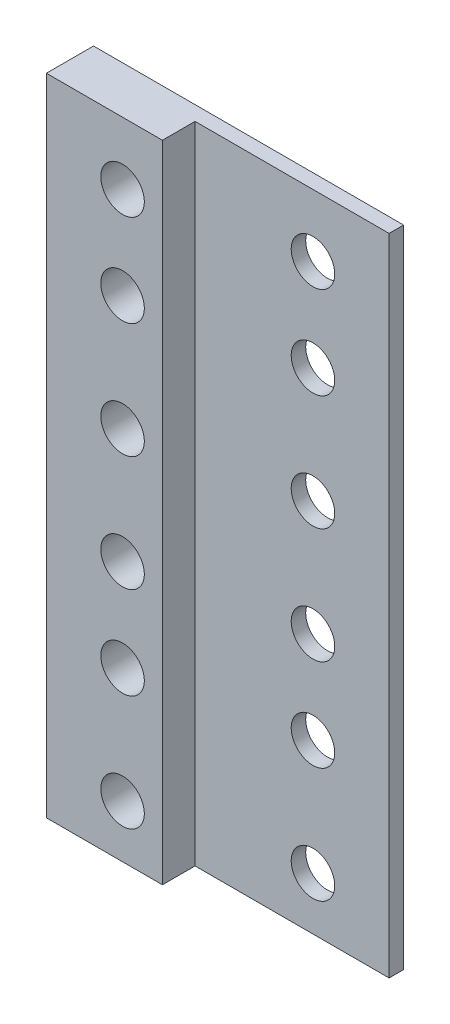
ISO-10303-21;
HEADER;
FILE_DESCRIPTION(('STEP AP214'),'2;1');
FILE_NAME('part.step','',(''),(''),'','','');
FILE_SCHEMA(('AUTOMOTIVE_DESIGN { 1 0 10303 214 1 1 1 1 }'));
ENDSEC;
DATA;
#1=APPLICATION_CONTEXT('core data for automotive mechanical design processes');
#2=APPLICATION_PROTOCOL_DEFINITION('international standard','automotive_design',2000,#1);
#3=PRODUCT_CONTEXT('',#1,'mechanical');
#4=PRODUCT('Part','Part','',(#3));
#5=PRODUCT_RELATED_PRODUCT_CATEGORY('part','',(#4));
#6=PRODUCT_DEFINITION_FORMATION('','',#4);
#7=PRODUCT_DEFINITION_CONTEXT('part definition',#1,'design');
#8=PRODUCT_DEFINITION('design','',#6,#7);
#9=PRODUCT_DEFINITION_SHAPE('','',#8);
#10=(LENGTH_UNIT() NAMED_UNIT(*) SI_UNIT(.MILLI.,.METRE.));
#11=(NAMED_UNIT(*) PLANE_ANGLE_UNIT() SI_UNIT($,.RADIAN.));
#12=(NAMED_UNIT(*) SI_UNIT($,.STERADIAN.) SOLID_ANGLE_UNIT());
#13=UNCERTAINTY_MEASURE_WITH_UNIT(LENGTH_MEASURE(1.E-05),#10,'distance_accuracy_value','');
#14=(GEOMETRIC_REPRESENTATION_CONTEXT(3) GLOBAL_UNCERTAINTY_ASSIGNED_CONTEXT((#13)) GLOBAL_UNIT_ASSIGNED_CONTEXT((#10,
#11,#12)) REPRESENTATION_CONTEXT('',''));
#15=CARTESIAN_POINT('',(0.,0.,0.));
#16=DIRECTION('',(0.,0.,1.));
#17=DIRECTION('',(1.,0.,0.));
#18=AXIS2_PLACEMENT_3D('',#15,#16,#17);
#19=CARTESIAN_POINT('',(0.,0.,2.));
#20=DIRECTION('',(0.,0.,-1.));
#21=DIRECTION('',(-1.,0.,0.));
#22=AXIS2_PLACEMENT_3D('',#19,#20,#21);
#23=PLANE('',#22);
#24=DIRECTION('',(-1.,0.,0.));
#25=VECTOR('',#24,1.);
#26=CARTESIAN_POINT('',(-25.25,88.9,2.));
#27=LINE('',#26,#25);
#28=CARTESIAN_POINT('',(17.5,88.9,2.));
#29=VERTEX_POINT('',#28);
#30=CARTESIAN_POINT('',(-9.24999999999999,88.9,2.));
#31=VERTEX_POINT('',#30);
#32=EDGE_CURVE('E55',#29,#31,#27,.T.);
#33=ORIENTED_EDGE('',*,*,#32,.T.);
#34=DIRECTION('',(0.,-1.,0.));
#35=VECTOR('',#34,1.);
#36=CARTESIAN_POINT('',(-9.24999999999999,0.,2.));
#37=LINE('',#36,#35);
#38=CARTESIAN_POINT('',(-9.24999999999999,0.,2.));
#39=VERTEX_POINT('',#38);
#40=EDGE_CURVE('E157',#31,#39,#37,.T.);
#41=ORIENTED_EDGE('',*,*,#40,.T.);
#42=DIRECTION('',(1.,0.,0.));
#43=VECTOR('',#42,1.);
#44=CARTESIAN_POINT('',(-25.25,0.,2.));
#45=LINE('',#44,#43);
#46=CARTESIAN_POINT('',(17.5,0.,2.));
#47=VERTEX_POINT('',#46);
#48=EDGE_CURVE('E93',#39,#47,#45,.T.);
#49=ORIENTED_EDGE('',*,*,#48,.T.);
#50=DIRECTION('',(0.,1.,0.));
#51=VECTOR('',#50,1.);
#52=CARTESIAN_POINT('',(17.5,0.,2.));
#53=LINE('',#52,#51);
#54=EDGE_CURVE('E61',#47,#29,#53,.T.);
#55=ORIENTED_EDGE('',*,*,#54,.T.);
#56=EDGE_LOOP('',(#33,#41,#49,#55));
#57=FACE_BOUND('',#56,.T.);
#58=CARTESIAN_POINT('',(6.99999999999999,80.29,2.));
#59=DIRECTION('',(0.,0.,-1.));
#60=DIRECTION('',(-1.,0.,0.));
#61=AXIS2_PLACEMENT_3D('',#58,#59,#60);
#62=CIRCLE('',#61,3.);
#63=CARTESIAN_POINT('',(3.99999999999999,80.29,2.));
#64=VERTEX_POINT('',#63);
#65=EDGE_CURVE('E109',#64,#64,#62,.T.);
#66=ORIENTED_EDGE('',*,*,#65,.T.);
#67=EDGE_LOOP('',(#66));
#68=FACE_BOUND('',#67,.T.);
#69=CARTESIAN_POINT('',(6.99999999999999,67.59,2.));
#70=DIRECTION('',(0.,0.,-1.));
#71=DIRECTION('',(-1.,0.,0.));
#72=AXIS2_PLACEMENT_3D('',#69,#70,#71);
#73=CIRCLE('',#72,3.);
#74=CARTESIAN_POINT('',(3.99999999999999,67.59,2.));
#75=VERTEX_POINT('',#74);
#76=EDGE_CURVE('E216',#75,#75,#73,.T.);
#77=ORIENTED_EDGE('',*,*,#76,.T.);
#78=EDGE_LOOP('',(#77));
#79=FACE_BOUND('',#78,.T.);
#80=CARTESIAN_POINT('',(6.99999999999999,51.71,2.));
#81=DIRECTION('',(0.,0.,-1.));
#82=DIRECTION('',(-1.,0.,0.));
#83=AXIS2_PLACEMENT_3D('',#80,#81,#82);
#84=CIRCLE('',#83,3.);
#85=CARTESIAN_POINT('',(3.99999999999999,51.71,2.));
#86=VERTEX_POINT('',#85);
#87=EDGE_CURVE('E204',#86,#86,#84,.T.);
#88=ORIENTED_EDGE('',*,*,#87,.T.);
#89=EDGE_LOOP('',(#88));
#90=FACE_BOUND('',#89,.T.);
#91=CARTESIAN_POINT('',(6.99999999999999,35.83,2.));
#92=DIRECTION('',(0.,0.,-1.));
#93=DIRECTION('',(-1.,0.,0.));
#94=AXIS2_PLACEMENT_3D('',#91,#92,#93);
#95=CIRCLE('',#94,3.);
#96=CARTESIAN_POINT('',(3.99999999999999,35.83,2.));
#97=VERTEX_POINT('',#96);
#98=EDGE_CURVE('E192',#97,#97,#95,.T.);
#99=ORIENTED_EDGE('',*,*,#98,.T.);
#100=EDGE_LOOP('',(#99));
#101=FACE_BOUND('',#100,.T.);
#102=CARTESIAN_POINT('',(6.99999999999999,23.13,2.));
#103=DIRECTION('',(0.,0.,-1.));
#104=DIRECTION('',(-1.,0.,0.));
#105=AXIS2_PLACEMENT_3D('',#102,#103,#104);
#106=CIRCLE('',#105,3.);
#107=CARTESIAN_POINT('',(3.99999999999999,23.13,2.));
#108=VERTEX_POINT('',#107);
#109=EDGE_CURVE('E180',#108,#108,#106,.T.);
#110=ORIENTED_EDGE('',*,*,#109,.T.);
#111=EDGE_LOOP('',(#110));
#112=FACE_BOUND('',#111,.T.);
#113=CARTESIAN_POINT('',(6.99999999999999,7.24999999999998,2.));
#114=DIRECTION('',(0.,0.,-1.));
#115=DIRECTION('',(-1.,0.,0.));
#116=AXIS2_PLACEMENT_3D('',#113,#114,#115);
#117=CIRCLE('',#116,3.);
#118=CARTESIAN_POINT('',(3.99999999999998,7.24999999999998,2.));
#119=VERTEX_POINT('',#118);
#120=EDGE_CURVE('E164',#119,#119,#117,.T.);
#121=ORIENTED_EDGE('',*,*,#120,.T.);
#122=EDGE_LOOP('',(#121));
#123=FACE_BOUND('',#122,.T.);
#124=ADVANCED_FACE('F39',(#57,#68,#79,#90,#101,#112,#123),#23,.F.);
#125=CARTESIAN_POINT('',(0.,0.,0.));
#126=DIRECTION('',(0.,0.,-1.));
#127=DIRECTION('',(-1.,0.,0.));
#128=AXIS2_PLACEMENT_3D('',#125,#126,#127);
#129=PLANE('',#128);
#130=DIRECTION('',(0.,1.,0.));
#131=VECTOR('',#130,1.);
#132=CARTESIAN_POINT('',(17.5,0.,0.));
#133=LINE('',#132,#131);
#134=CARTESIAN_POINT('',(17.5,0.,0.));
#135=VERTEX_POINT('',#134);
#136=CARTESIAN_POINT('',(17.5,88.9,0.));
#137=VERTEX_POINT('',#136);
#138=EDGE_CURVE('E94',#135,#137,#133,.T.);
#139=ORIENTED_EDGE('',*,*,#138,.F.);
#140=DIRECTION('',(1.,0.,0.));
#141=VECTOR('',#140,1.);
#142=CARTESIAN_POINT('',(-25.25,0.,0.));
#143=LINE('',#142,#141);
#144=CARTESIAN_POINT('',(-25.25,0.,0.));
#145=VERTEX_POINT('',#144);
#146=EDGE_CURVE('E107',#145,#135,#143,.T.);
#147=ORIENTED_EDGE('',*,*,#146,.F.);
#148=DIRECTION('',(0.,-1.,0.));
#149=VECTOR('',#148,1.);
#150=CARTESIAN_POINT('',(-25.25,0.,0.));
#151=LINE('',#150,#149);
#152=CARTESIAN_POINT('',(-25.25,88.9,0.));
#153=VERTEX_POINT('',#152);
#154=EDGE_CURVE('E99',#153,#145,#151,.T.);
#155=ORIENTED_EDGE('',*,*,#154,.F.);
#156=DIRECTION('',(-1.,0.,0.));
#157=VECTOR('',#156,1.);
#158=CARTESIAN_POINT('',(-25.25,88.9,0.));
#159=LINE('',#158,#157);
#160=EDGE_CURVE('E81',#137,#153,#159,.T.);
#161=ORIENTED_EDGE('',*,*,#160,.F.);
#162=EDGE_LOOP('',(#139,#147,#155,#161));
#163=FACE_BOUND('',#162,.T.);
#164=CARTESIAN_POINT('',(6.99999999999999,80.29,0.));
#165=DIRECTION('',(0.,0.,-1.));
#166=DIRECTION('',(-1.,0.,0.));
#167=AXIS2_PLACEMENT_3D('',#164,#165,#166);
#168=CIRCLE('',#167,3.);
#169=CARTESIAN_POINT('',(3.99999999999999,80.29,0.));
#170=VERTEX_POINT('',#169);
#171=EDGE_CURVE('E115',#170,#170,#168,.T.);
#172=ORIENTED_EDGE('',*,*,#171,.F.);
#173=EDGE_LOOP('',(#172));
#174=FACE_BOUND('',#173,.T.);
#175=CARTESIAN_POINT('',(6.99999999999999,67.59,0.));
#176=DIRECTION('',(0.,0.,-1.));
#177=DIRECTION('',(-1.,0.,0.));
#178=AXIS2_PLACEMENT_3D('',#175,#176,#177);
#179=CIRCLE('',#178,3.);
#180=CARTESIAN_POINT('',(3.99999999999999,67.59,0.));
#181=VERTEX_POINT('',#180);
#182=EDGE_CURVE('E215',#181,#181,#179,.T.);
#183=ORIENTED_EDGE('',*,*,#182,.F.);
#184=EDGE_LOOP('',(#183));
#185=FACE_BOUND('',#184,.T.);
#186=CARTESIAN_POINT('',(6.99999999999999,51.71,0.));
#187=DIRECTION('',(0.,0.,-1.));
#188=DIRECTION('',(-1.,0.,0.));
#189=AXIS2_PLACEMENT_3D('',#186,#187,#188);
#190=CIRCLE('',#189,3.);
#191=CARTESIAN_POINT('',(3.99999999999999,51.71,0.));
#192=VERTEX_POINT('',#191);
#193=EDGE_CURVE('E203',#192,#192,#190,.T.);
#194=ORIENTED_EDGE('',*,*,#193,.F.);
#195=EDGE_LOOP('',(#194));
#196=FACE_BOUND('',#195,.T.);
#197=CARTESIAN_POINT('',(6.99999999999999,35.83,0.));
#198=DIRECTION('',(0.,0.,-1.));
#199=DIRECTION('',(-1.,0.,0.));
#200=AXIS2_PLACEMENT_3D('',#197,#198,#199);
#201=CIRCLE('',#200,3.);
#202=CARTESIAN_POINT('',(3.99999999999999,35.83,0.));
#203=VERTEX_POINT('',#202);
#204=EDGE_CURVE('E191',#203,#203,#201,.T.);
#205=ORIENTED_EDGE('',*,*,#204,.F.);
#206=EDGE_LOOP('',(#205));
#207=FACE_BOUND('',#206,.T.);
#208=CARTESIAN_POINT('',(6.99999999999999,23.13,0.));
#209=DIRECTION('',(0.,0.,-1.));
#210=DIRECTION('',(-1.,0.,0.));
#211=AXIS2_PLACEMENT_3D('',#208,#209,#210);
#212=CIRCLE('',#211,3.);
#213=CARTESIAN_POINT('',(3.99999999999999,23.13,0.));
#214=VERTEX_POINT('',#213);
#215=EDGE_CURVE('E179',#214,#214,#212,.T.);
#216=ORIENTED_EDGE('',*,*,#215,.F.);
#217=EDGE_LOOP('',(#216));
#218=FACE_BOUND('',#217,.T.);
#219=CARTESIAN_POINT('',(6.99999999999999,7.24999999999998,0.));
#220=DIRECTION('',(0.,0.,-1.));
#221=DIRECTION('',(-1.,0.,0.));
#222=AXIS2_PLACEMENT_3D('',#219,#220,#221);
#223=CIRCLE('',#222,3.);
#224=CARTESIAN_POINT('',(3.99999999999998,7.24999999999998,0.));
#225=VERTEX_POINT('',#224);
#226=EDGE_CURVE('E163',#225,#225,#223,.T.);
#227=ORIENTED_EDGE('',*,*,#226,.F.);
#228=EDGE_LOOP('',(#227));
#229=FACE_BOUND('',#228,.T.);
#230=CARTESIAN_POINT('',(-14.7499999999999,7.24999999999998,0.));
#231=DIRECTION('',(0.,0.,-1.));
#232=DIRECTION('',(-1.,0.,0.));
#233=AXIS2_PLACEMENT_3D('',#230,#231,#232);
#234=CIRCLE('',#233,3.);
#235=CARTESIAN_POINT('',(-17.7499999999999,7.24999999999998,0.));
#236=VERTEX_POINT('',#235);
#237=EDGE_CURVE('E168',#236,#236,#234,.T.);
#238=ORIENTED_EDGE('',*,*,#237,.F.);
#239=EDGE_LOOP('',(#238));
#240=FACE_BOUND('',#239,.T.);
#241=CARTESIAN_POINT('',(-14.7499999999999,23.13,0.));
#242=DIRECTION('',(0.,0.,-1.));
#243=DIRECTION('',(-1.,0.,0.));
#244=AXIS2_PLACEMENT_3D('',#241,#242,#243);
#245=CIRCLE('',#244,3.);
#246=CARTESIAN_POINT('',(-17.7499999999999,23.13,0.));
#247=VERTEX_POINT('',#246);
#248=EDGE_CURVE('E175',#247,#247,#245,.T.);
#249=ORIENTED_EDGE('',*,*,#248,.F.);
#250=EDGE_LOOP('',(#249));
#251=FACE_BOUND('',#250,.T.);
#252=CARTESIAN_POINT('',(-14.7499999999999,35.83,0.));
#253=DIRECTION('',(0.,0.,-1.));
#254=DIRECTION('',(-1.,0.,0.));
#255=AXIS2_PLACEMENT_3D('',#252,#253,#254);
#256=CIRCLE('',#255,3.);
#257=CARTESIAN_POINT('',(-17.7499999999999,35.83,0.));
#258=VERTEX_POINT('',#257);
#259=EDGE_CURVE('E184',#258,#258,#256,.T.);
#260=ORIENTED_EDGE('',*,*,#259,.F.);
#261=EDGE_LOOP('',(#260));
#262=FACE_BOUND('',#261,.T.);
#263=CARTESIAN_POINT('',(-14.7499999999999,51.71,0.));
#264=DIRECTION('',(0.,0.,-1.));
#265=DIRECTION('',(-1.,0.,0.));
#266=AXIS2_PLACEMENT_3D('',#263,#264,#265);
#267=CIRCLE('',#266,3.);
#268=CARTESIAN_POINT('',(-17.7499999999999,51.71,0.));
#269=VERTEX_POINT('',#268);
#270=EDGE_CURVE('E196',#269,#269,#267,.T.);
#271=ORIENTED_EDGE('',*,*,#270,.F.);
#272=EDGE_LOOP('',(#271));
#273=FACE_BOUND('',#272,.T.);
#274=CARTESIAN_POINT('',(-14.7499999999999,67.59,0.));
#275=DIRECTION('',(0.,0.,-1.));
#276=DIRECTION('',(-1.,0.,0.));
#277=AXIS2_PLACEMENT_3D('',#274,#275,#276);
#278=CIRCLE('',#277,3.);
#279=CARTESIAN_POINT('',(-17.7499999999999,67.59,0.));
#280=VERTEX_POINT('',#279);
#281=EDGE_CURVE('E208',#280,#280,#278,.T.);
#282=ORIENTED_EDGE('',*,*,#281,.F.);
#283=EDGE_LOOP('',(#282));
#284=FACE_BOUND('',#283,.T.);
#285=CARTESIAN_POINT('',(-14.7499999999999,80.29,0.));
#286=DIRECTION('',(0.,0.,-1.));
#287=DIRECTION('',(-1.,0.,0.));
#288=AXIS2_PLACEMENT_3D('',#285,#286,#287);
#289=CIRCLE('',#288,3.);
#290=CARTESIAN_POINT('',(-17.7499999999999,80.29,0.));
#291=VERTEX_POINT('',#290);
#292=EDGE_CURVE('E220',#291,#291,#289,.T.);
#293=ORIENTED_EDGE('',*,*,#292,.F.);
#294=EDGE_LOOP('',(#293));
#295=FACE_BOUND('',#294,.T.);
#296=ADVANCED_FACE('F105',(#163,#174,#185,#196,#207,#218,#229,#240,#251,#262,#273,#284,#295),
#129,.T.);
#297=CARTESIAN_POINT('',(-25.25,0.,2.));
#298=DIRECTION('',(1.,0.,0.));
#299=DIRECTION('',(0.,1.,0.));
#300=AXIS2_PLACEMENT_3D('',#297,#298,#299);
#301=PLANE('',#300);
#302=ORIENTED_EDGE('',*,*,#154,.T.);
#303=DIRECTION('',(0.,0.,-1.));
#304=VECTOR('',#303,1.);
#305=CARTESIAN_POINT('',(-25.25,0.,2.));
#306=LINE('',#305,#304);
#307=CARTESIAN_POINT('',(-25.25,0.,6.5));
#308=VERTEX_POINT('',#307);
#309=EDGE_CURVE('E11',#308,#145,#306,.T.);
#310=ORIENTED_EDGE('',*,*,#309,.F.);
#311=DIRECTION('',(0.,1.,0.));
#312=VECTOR('',#311,1.);
#313=CARTESIAN_POINT('',(-25.25,88.9,6.5));
#314=LINE('',#313,#312);
#315=CARTESIAN_POINT('',(-25.25,88.9,6.5));
#316=VERTEX_POINT('',#315);
#317=EDGE_CURVE('E101',#308,#316,#314,.T.);
#318=ORIENTED_EDGE('',*,*,#317,.T.);
#319=DIRECTION('',(0.,0.,-1.));
#320=VECTOR('',#319,1.);
#321=CARTESIAN_POINT('',(-25.25,88.9,2.));
#322=LINE('',#321,#320);
#323=EDGE_CURVE('E86',#316,#153,#322,.T.);
#324=ORIENTED_EDGE('',*,*,#323,.T.);
#325=EDGE_LOOP('',(#302,#310,#318,#324));
#326=FACE_BOUND('',#325,.T.);
#327=ADVANCED_FACE('F41',(#326),#301,.F.);
#328=CARTESIAN_POINT('',(-25.25,0.,2.));
#329=DIRECTION('',(0.,1.,0.));
#330=DIRECTION('',(0.,0.,1.));
#331=AXIS2_PLACEMENT_3D('',#328,#329,#330);
#332=PLANE('',#331);
#333=ORIENTED_EDGE('',*,*,#48,.F.);
#334=DIRECTION('',(0.,0.,-1.));
#335=VECTOR('',#334,1.);
#336=CARTESIAN_POINT('',(-9.24999999999999,0.,6.5));
#337=LINE('',#336,#335);
#338=CARTESIAN_POINT('',(-9.24999999999999,0.,6.5));
#339=VERTEX_POINT('',#338);
#340=EDGE_CURVE('E147',#339,#39,#337,.T.);
#341=ORIENTED_EDGE('',*,*,#340,.F.);
#342=DIRECTION('',(-1.,0.,0.));
#343=VECTOR('',#342,1.);
#344=CARTESIAN_POINT('',(-9.24999999999999,0.,6.5));
#345=LINE('',#344,#343);
#346=EDGE_CURVE('E135',#339,#308,#345,.T.);
#347=ORIENTED_EDGE('',*,*,#346,.T.);
#348=ORIENTED_EDGE('',*,*,#309,.T.);
#349=ORIENTED_EDGE('',*,*,#146,.T.);
#350=DIRECTION('',(0.,0.,-1.));
#351=VECTOR('',#350,1.);
#352=CARTESIAN_POINT('',(17.5,0.,2.));
#353=LINE('',#352,#351);
#354=EDGE_CURVE('E48',#47,#135,#353,.T.);
#355=ORIENTED_EDGE('',*,*,#354,.F.);
#356=EDGE_LOOP('',(#333,#341,#347,#348,#349,#355));
#357=FACE_BOUND('',#356,.T.);
#358=ADVANCED_FACE('F130',(#357),#332,.F.);
#359=CARTESIAN_POINT('',(17.5,0.,2.));
#360=DIRECTION('',(-1.,0.,0.));
#361=DIRECTION('',(0.,0.,1.));
#362=AXIS2_PLACEMENT_3D('',#359,#360,#361);
#363=PLANE('',#362);
#364=ORIENTED_EDGE('',*,*,#138,.T.);
#365=DIRECTION('',(0.,0.,-1.));
#366=VECTOR('',#365,1.);
#367=CARTESIAN_POINT('',(17.5,88.9,2.));
#368=LINE('',#367,#366);
#369=EDGE_CURVE('E88',#29,#137,#368,.T.);
#370=ORIENTED_EDGE('',*,*,#369,.F.);
#371=ORIENTED_EDGE('',*,*,#54,.F.);
#372=ORIENTED_EDGE('',*,*,#354,.T.);
#373=EDGE_LOOP('',(#364,#370,#371,#372));
#374=FACE_BOUND('',#373,.T.);
#375=ADVANCED_FACE('F127',(#374),#363,.F.);
#376=CARTESIAN_POINT('',(-25.25,88.9,2.));
#377=DIRECTION('',(0.,-1.,0.));
#378=DIRECTION('',(0.,0.,-1.));
#379=AXIS2_PLACEMENT_3D('',#376,#377,#378);
#380=PLANE('',#379);
#381=ORIENTED_EDGE('',*,*,#160,.T.);
#382=ORIENTED_EDGE('',*,*,#323,.F.);
#383=DIRECTION('',(1.,0.,0.));
#384=VECTOR('',#383,1.);
#385=CARTESIAN_POINT('',(-9.24999999999999,88.9,6.5));
#386=LINE('',#385,#384);
#387=CARTESIAN_POINT('',(-9.24999999999999,88.9,6.5));
#388=VERTEX_POINT('',#387);
#389=EDGE_CURVE('E142',#316,#388,#386,.T.);
#390=ORIENTED_EDGE('',*,*,#389,.T.);
#391=DIRECTION('',(0.,0.,-1.));
#392=VECTOR('',#391,1.);
#393=CARTESIAN_POINT('',(-9.24999999999999,88.9,6.5));
#394=LINE('',#393,#392);
#395=EDGE_CURVE('E153',#388,#31,#394,.T.);
#396=ORIENTED_EDGE('',*,*,#395,.T.);
#397=ORIENTED_EDGE('',*,*,#32,.F.);
#398=ORIENTED_EDGE('',*,*,#369,.T.);
#399=EDGE_LOOP('',(#381,#382,#390,#396,#397,#398));
#400=FACE_BOUND('',#399,.T.);
#401=ADVANCED_FACE('F83',(#400),#380,.F.);
#402=CARTESIAN_POINT('',(6.99999999999999,80.29,2.));
#403=DIRECTION('',(0.,0.,-1.));
#404=DIRECTION('',(-1.,0.,0.));
#405=AXIS2_PLACEMENT_3D('',#402,#403,#404);
#406=CYLINDRICAL_SURFACE('',#405,3.);
#407=ORIENTED_EDGE('',*,*,#65,.F.);
#408=EDGE_LOOP('',(#407));
#409=FACE_BOUND('',#408,.T.);
#410=ORIENTED_EDGE('',*,*,#171,.T.);
#411=EDGE_LOOP('',(#410));
#412=FACE_BOUND('',#411,.T.);
#413=ADVANCED_FACE('F294',(#409,#412),#406,.F.);
#414=CARTESIAN_POINT('',(-14.7499999999999,80.29,2.));
#415=DIRECTION('',(0.,0.,-1.));
#416=DIRECTION('',(-1.,0.,0.));
#417=AXIS2_PLACEMENT_3D('',#414,#415,#416);
#418=CYLINDRICAL_SURFACE('',#417,3.);
#419=ORIENTED_EDGE('',*,*,#292,.T.);
#420=EDGE_LOOP('',(#419));
#421=FACE_BOUND('',#420,.T.);
#422=CARTESIAN_POINT('',(-14.7499999999999,80.29,6.5));
#423=DIRECTION('',(0.,0.,-1.));
#424=DIRECTION('',(-1.,0.,0.));
#425=AXIS2_PLACEMENT_3D('',#422,#423,#424);
#426=CIRCLE('',#425,3.);
#427=CARTESIAN_POINT('',(-17.7499999999999,80.29,6.5));
#428=VERTEX_POINT('',#427);
#429=EDGE_CURVE('E242',#428,#428,#426,.T.);
#430=ORIENTED_EDGE('',*,*,#429,.F.);
#431=EDGE_LOOP('',(#430));
#432=FACE_BOUND('',#431,.T.);
#433=ADVANCED_FACE('F342',(#421,#432),#418,.F.);
#434=CARTESIAN_POINT('',(6.99999999999999,67.59,2.));
#435=DIRECTION('',(0.,0.,-1.));
#436=DIRECTION('',(-1.,0.,0.));
#437=AXIS2_PLACEMENT_3D('',#434,#435,#436);
#438=CYLINDRICAL_SURFACE('',#437,3.);
#439=ORIENTED_EDGE('',*,*,#76,.F.);
#440=EDGE_LOOP('',(#439));
#441=FACE_BOUND('',#440,.T.);
#442=ORIENTED_EDGE('',*,*,#182,.T.);
#443=EDGE_LOOP('',(#442));
#444=FACE_BOUND('',#443,.T.);
#445=ADVANCED_FACE('F339',(#441,#444),#438,.F.);
#446=CARTESIAN_POINT('',(-14.7499999999999,67.59,2.));
#447=DIRECTION('',(0.,0.,-1.));
#448=DIRECTION('',(-1.,0.,0.));
#449=AXIS2_PLACEMENT_3D('',#446,#447,#448);
#450=CYLINDRICAL_SURFACE('',#449,3.);
#451=ORIENTED_EDGE('',*,*,#281,.T.);
#452=EDGE_LOOP('',(#451));
#453=FACE_BOUND('',#452,.T.);
#454=CARTESIAN_POINT('',(-14.7499999999999,67.59,6.5));
#455=DIRECTION('',(0.,0.,-1.));
#456=DIRECTION('',(-1.,0.,0.));
#457=AXIS2_PLACEMENT_3D('',#454,#455,#456);
#458=CIRCLE('',#457,3.);
#459=CARTESIAN_POINT('',(-17.7499999999999,67.59,6.5));
#460=VERTEX_POINT('',#459);
#461=EDGE_CURVE('E245',#460,#460,#458,.T.);
#462=ORIENTED_EDGE('',*,*,#461,.F.);
#463=EDGE_LOOP('',(#462));
#464=FACE_BOUND('',#463,.T.);
#465=ADVANCED_FACE('F333',(#453,#464),#450,.F.);
#466=CARTESIAN_POINT('',(6.99999999999999,51.71,2.));
#467=DIRECTION('',(0.,0.,-1.));
#468=DIRECTION('',(-1.,0.,0.));
#469=AXIS2_PLACEMENT_3D('',#466,#467,#468);
#470=CYLINDRICAL_SURFACE('',#469,3.);
#471=ORIENTED_EDGE('',*,*,#87,.F.);
#472=EDGE_LOOP('',(#471));
#473=FACE_BOUND('',#472,.T.);
#474=ORIENTED_EDGE('',*,*,#193,.T.);
#475=EDGE_LOOP('',(#474));
#476=FACE_BOUND('',#475,.T.);
#477=ADVANCED_FACE('F330',(#473,#476),#470,.F.);
#478=CARTESIAN_POINT('',(-14.7499999999999,51.71,2.));
#479=DIRECTION('',(0.,0.,-1.));
#480=DIRECTION('',(-1.,0.,0.));
#481=AXIS2_PLACEMENT_3D('',#478,#479,#480);
#482=CYLINDRICAL_SURFACE('',#481,3.);
#483=ORIENTED_EDGE('',*,*,#270,.T.);
#484=EDGE_LOOP('',(#483));
#485=FACE_BOUND('',#484,.T.);
#486=CARTESIAN_POINT('',(-14.7499999999999,51.71,6.5));
#487=DIRECTION('',(0.,0.,-1.));
#488=DIRECTION('',(-1.,0.,0.));
#489=AXIS2_PLACEMENT_3D('',#486,#487,#488);
#490=CIRCLE('',#489,3.);
#491=CARTESIAN_POINT('',(-17.7499999999999,51.71,6.5));
#492=VERTEX_POINT('',#491);
#493=EDGE_CURVE('E251',#492,#492,#490,.T.);
#494=ORIENTED_EDGE('',*,*,#493,.F.);
#495=EDGE_LOOP('',(#494));
#496=FACE_BOUND('',#495,.T.);
#497=ADVANCED_FACE('F324',(#485,#496),#482,.F.);
#498=CARTESIAN_POINT('',(6.99999999999999,35.83,2.));
#499=DIRECTION('',(0.,0.,-1.));
#500=DIRECTION('',(-1.,0.,0.));
#501=AXIS2_PLACEMENT_3D('',#498,#499,#500);
#502=CYLINDRICAL_SURFACE('',#501,3.);
#503=ORIENTED_EDGE('',*,*,#98,.F.);
#504=EDGE_LOOP('',(#503));
#505=FACE_BOUND('',#504,.T.);
#506=ORIENTED_EDGE('',*,*,#204,.T.);
#507=EDGE_LOOP('',(#506));
#508=FACE_BOUND('',#507,.T.);
#509=ADVANCED_FACE('F321',(#505,#508),#502,.F.);
#510=CARTESIAN_POINT('',(-14.7499999999999,35.83,2.));
#511=DIRECTION('',(0.,0.,-1.));
#512=DIRECTION('',(-1.,0.,0.));
#513=AXIS2_PLACEMENT_3D('',#510,#511,#512);
#514=CYLINDRICAL_SURFACE('',#513,3.);
#515=ORIENTED_EDGE('',*,*,#259,.T.);
#516=EDGE_LOOP('',(#515));
#517=FACE_BOUND('',#516,.T.);
#518=CARTESIAN_POINT('',(-14.7499999999999,35.83,6.5));
#519=DIRECTION('',(0.,0.,-1.));
#520=DIRECTION('',(-1.,0.,0.));
#521=AXIS2_PLACEMENT_3D('',#518,#519,#520);
#522=CIRCLE('',#521,3.);
#523=CARTESIAN_POINT('',(-17.7499999999999,35.83,6.5));
#524=VERTEX_POINT('',#523);
#525=EDGE_CURVE('E255',#524,#524,#522,.T.);
#526=ORIENTED_EDGE('',*,*,#525,.F.);
#527=EDGE_LOOP('',(#526));
#528=FACE_BOUND('',#527,.T.);
#529=ADVANCED_FACE('F315',(#517,#528),#514,.F.);
#530=CARTESIAN_POINT('',(6.99999999999999,23.13,2.));
#531=DIRECTION('',(0.,0.,-1.));
#532=DIRECTION('',(-1.,0.,0.));
#533=AXIS2_PLACEMENT_3D('',#530,#531,#532);
#534=CYLINDRICAL_SURFACE('',#533,3.);
#535=ORIENTED_EDGE('',*,*,#109,.F.);
#536=EDGE_LOOP('',(#535));
#537=FACE_BOUND('',#536,.T.);
#538=ORIENTED_EDGE('',*,*,#215,.T.);
#539=EDGE_LOOP('',(#538));
#540=FACE_BOUND('',#539,.T.);
#541=ADVANCED_FACE('F283',(#537,#540),#534,.F.);
#542=CARTESIAN_POINT('',(-14.7499999999999,23.13,2.));
#543=DIRECTION('',(0.,0.,-1.));
#544=DIRECTION('',(-1.,0.,0.));
#545=AXIS2_PLACEMENT_3D('',#542,#543,#544);
#546=CYLINDRICAL_SURFACE('',#545,3.);
#547=ORIENTED_EDGE('',*,*,#248,.T.);
#548=EDGE_LOOP('',(#547));
#549=FACE_BOUND('',#548,.T.);
#550=CARTESIAN_POINT('',(-14.7499999999999,23.13,6.5));
#551=DIRECTION('',(0.,0.,-1.));
#552=DIRECTION('',(-1.,0.,0.));
#553=AXIS2_PLACEMENT_3D('',#550,#551,#552);
#554=CIRCLE('',#553,3.);
#555=CARTESIAN_POINT('',(-17.7499999999999,23.13,6.5));
#556=VERTEX_POINT('',#555);
#557=EDGE_CURVE('E259',#556,#556,#554,.T.);
#558=ORIENTED_EDGE('',*,*,#557,.F.);
#559=EDGE_LOOP('',(#558));
#560=FACE_BOUND('',#559,.T.);
#561=ADVANCED_FACE('F273',(#549,#560),#546,.F.);
#562=CARTESIAN_POINT('',(-14.7499999999999,7.24999999999998,2.));
#563=DIRECTION('',(0.,0.,-1.));
#564=DIRECTION('',(-1.,0.,0.));
#565=AXIS2_PLACEMENT_3D('',#562,#563,#564);
#566=CYLINDRICAL_SURFACE('',#565,3.);
#567=ORIENTED_EDGE('',*,*,#237,.T.);
#568=EDGE_LOOP('',(#567));
#569=FACE_BOUND('',#568,.T.);
#570=CARTESIAN_POINT('',(-14.7499999999999,7.24999999999998,6.5));
#571=DIRECTION('',(0.,0.,-1.));
#572=DIRECTION('',(-1.,0.,0.));
#573=AXIS2_PLACEMENT_3D('',#570,#571,#572);
#574=CIRCLE('',#573,3.);
#575=CARTESIAN_POINT('',(-17.7499999999999,7.24999999999998,6.5));
#576=VERTEX_POINT('',#575);
#577=EDGE_CURVE('E263',#576,#576,#574,.T.);
#578=ORIENTED_EDGE('',*,*,#577,.F.);
#579=EDGE_LOOP('',(#578));
#580=FACE_BOUND('',#579,.T.);
#581=ADVANCED_FACE('F270',(#569,#580),#566,.F.);
#582=CARTESIAN_POINT('',(6.99999999999999,7.24999999999998,2.));
#583=DIRECTION('',(0.,0.,-1.));
#584=DIRECTION('',(-1.,0.,0.));
#585=AXIS2_PLACEMENT_3D('',#582,#583,#584);
#586=CYLINDRICAL_SURFACE('',#585,3.);
#587=ORIENTED_EDGE('',*,*,#120,.F.);
#588=EDGE_LOOP('',(#587));
#589=FACE_BOUND('',#588,.T.);
#590=ORIENTED_EDGE('',*,*,#226,.T.);
#591=EDGE_LOOP('',(#590));
#592=FACE_BOUND('',#591,.T.);
#593=ADVANCED_FACE('F272',(#589,#592),#586,.F.);
#594=CARTESIAN_POINT('',(-9.24999999999999,88.9,6.5));
#595=DIRECTION('',(1.,0.,0.));
#596=DIRECTION('',(0.,0.,-1.));
#597=AXIS2_PLACEMENT_3D('',#594,#595,#596);
#598=PLANE('',#597);
#599=ORIENTED_EDGE('',*,*,#40,.F.);
#600=ORIENTED_EDGE('',*,*,#395,.F.);
#601=DIRECTION('',(0.,-1.,0.));
#602=VECTOR('',#601,1.);
#603=CARTESIAN_POINT('',(-9.24999999999999,88.9,6.5));
#604=LINE('',#603,#602);
#605=EDGE_CURVE('E149',#388,#339,#604,.T.);
#606=ORIENTED_EDGE('',*,*,#605,.T.);
#607=ORIENTED_EDGE('',*,*,#340,.T.);
#608=EDGE_LOOP('',(#599,#600,#606,#607));
#609=FACE_BOUND('',#608,.T.);
#610=ADVANCED_FACE('F237',(#609),#598,.T.);
#611=CARTESIAN_POINT('',(0.,0.,6.5));
#612=DIRECTION('',(0.,0.,-1.));
#613=DIRECTION('',(-1.,0.,0.));
#614=AXIS2_PLACEMENT_3D('',#611,#612,#613);
#615=PLANE('',#614);
#616=ORIENTED_EDGE('',*,*,#577,.T.);
#617=EDGE_LOOP('',(#616));
#618=FACE_BOUND('',#617,.T.);
#619=ORIENTED_EDGE('',*,*,#557,.T.);
#620=EDGE_LOOP('',(#619));
#621=FACE_BOUND('',#620,.T.);
#622=ORIENTED_EDGE('',*,*,#525,.T.);
#623=EDGE_LOOP('',(#622));
#624=FACE_BOUND('',#623,.T.);
#625=ORIENTED_EDGE('',*,*,#493,.T.);
#626=EDGE_LOOP('',(#625));
#627=FACE_BOUND('',#626,.T.);
#628=ORIENTED_EDGE('',*,*,#461,.T.);
#629=EDGE_LOOP('',(#628));
#630=FACE_BOUND('',#629,.T.);
#631=ORIENTED_EDGE('',*,*,#429,.T.);
#632=EDGE_LOOP('',(#631));
#633=FACE_BOUND('',#632,.T.);
#634=ORIENTED_EDGE('',*,*,#605,.F.);
#635=ORIENTED_EDGE('',*,*,#389,.F.);
#636=ORIENTED_EDGE('',*,*,#317,.F.);
#637=ORIENTED_EDGE('',*,*,#346,.F.);
#638=EDGE_LOOP('',(#634,#635,#636,#637));
#639=FACE_BOUND('',#638,.T.);
#640=ADVANCED_FACE('F140',(#618,#621,#624,#627,#630,#633,#639),#615,.F.);
#641=CLOSED_SHELL('',(#124,#296,#327,#358,#375,#401,#413,#433,#445,#465,#477,#497,#509,#529,
#541,#561,#581,#593,#610,#640));
#642=MANIFOLD_SOLID_BREP('B2',#641);
#643=ADVANCED_BREP_SHAPE_REPRESENTATION('',(#18,#642),#14);
#644=SHAPE_DEFINITION_REPRESENTATION(#9,#643);
ENDSEC;
END-ISO-10303-21;
